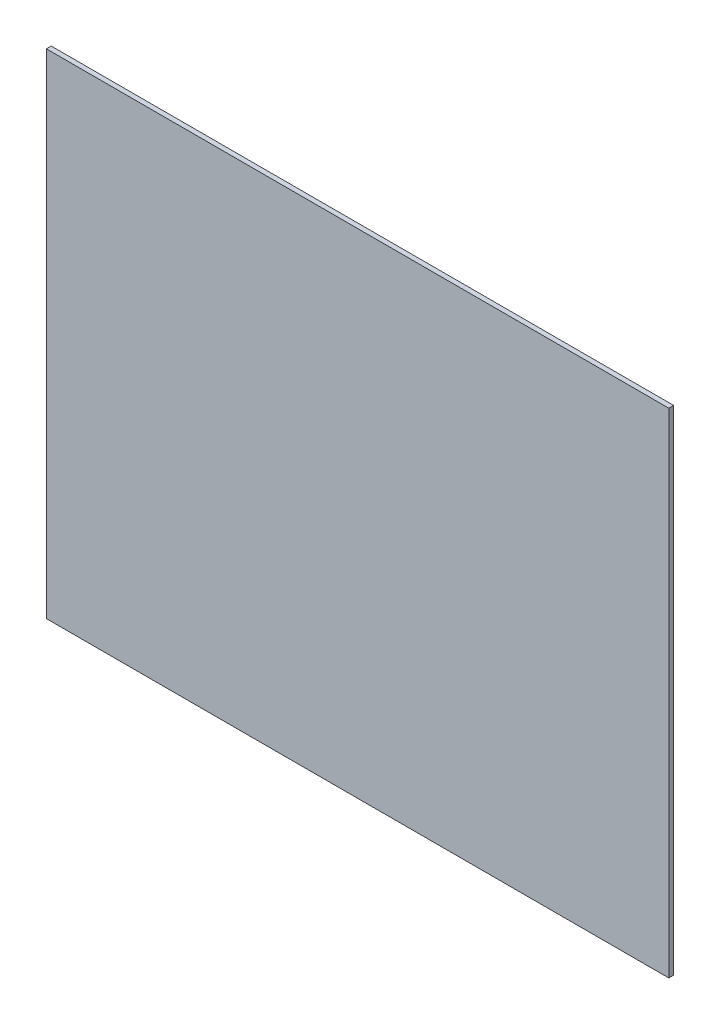
ISO-10303-21;
HEADER;
FILE_DESCRIPTION(('STEP AP214'),'2;1');
FILE_NAME('part.step','',(''),(''),'','','');
FILE_SCHEMA(('AUTOMOTIVE_DESIGN { 1 0 10303 214 1 1 1 1 }'));
ENDSEC;
DATA;
#1=APPLICATION_CONTEXT('core data for automotive mechanical design processes');
#2=APPLICATION_PROTOCOL_DEFINITION('international standard','automotive_design',2000,#1);
#3=PRODUCT_CONTEXT('',#1,'mechanical');
#4=PRODUCT('Part','Part','',(#3));
#5=PRODUCT_RELATED_PRODUCT_CATEGORY('part','',(#4));
#6=PRODUCT_DEFINITION_FORMATION('','',#4);
#7=PRODUCT_DEFINITION_CONTEXT('part definition',#1,'design');
#8=PRODUCT_DEFINITION('design','',#6,#7);
#9=PRODUCT_DEFINITION_SHAPE('','',#8);
#10=(LENGTH_UNIT() NAMED_UNIT(*) SI_UNIT(.MILLI.,.METRE.));
#11=(NAMED_UNIT(*) PLANE_ANGLE_UNIT() SI_UNIT($,.RADIAN.));
#12=(NAMED_UNIT(*) SI_UNIT($,.STERADIAN.) SOLID_ANGLE_UNIT());
#13=UNCERTAINTY_MEASURE_WITH_UNIT(LENGTH_MEASURE(1.E-05),#10,'distance_accuracy_value','');
#14=(GEOMETRIC_REPRESENTATION_CONTEXT(3) GLOBAL_UNCERTAINTY_ASSIGNED_CONTEXT((#13)) GLOBAL_UNIT_ASSIGNED_CONTEXT((#10,
#11,#12)) REPRESENTATION_CONTEXT('',''));
#15=CARTESIAN_POINT('',(0.,0.,0.));
#16=DIRECTION('',(0.,0.,1.));
#17=DIRECTION('',(1.,0.,0.));
#18=AXIS2_PLACEMENT_3D('',#15,#16,#17);
#19=CARTESIAN_POINT('',(289.5,-229.5,2.2479));
#20=DIRECTION('',(-1.,0.,0.));
#21=DIRECTION('',(0.,0.,1.));
#22=AXIS2_PLACEMENT_3D('',#19,#20,#21);
#23=PLANE('',#22);
#24=DIRECTION('',(0.,1.,0.));
#25=VECTOR('',#24,1.);
#26=CARTESIAN_POINT('',(289.5,-229.5,-2.2479));
#27=LINE('',#26,#25);
#28=CARTESIAN_POINT('',(289.5,-229.5,-2.2479));
#29=VERTEX_POINT('',#28);
#30=CARTESIAN_POINT('',(289.5,229.5,-2.2479));
#31=VERTEX_POINT('',#30);
#32=EDGE_CURVE('E96',#29,#31,#27,.T.);
#33=ORIENTED_EDGE('',*,*,#32,.T.);
#34=DIRECTION('',(0.,0.,-1.));
#35=VECTOR('',#34,1.);
#36=CARTESIAN_POINT('',(289.5,229.5,2.2479));
#37=LINE('',#36,#35);
#38=CARTESIAN_POINT('',(289.5,229.5,2.2479));
#39=VERTEX_POINT('',#38);
#40=EDGE_CURVE('E11',#39,#31,#37,.T.);
#41=ORIENTED_EDGE('',*,*,#40,.F.);
#42=DIRECTION('',(0.,1.,0.));
#43=VECTOR('',#42,1.);
#44=CARTESIAN_POINT('',(289.5,-229.5,2.2479));
#45=LINE('',#44,#43);
#46=CARTESIAN_POINT('',(289.5,-229.5,2.2479));
#47=VERTEX_POINT('',#46);
#48=EDGE_CURVE('E84',#47,#39,#45,.T.);
#49=ORIENTED_EDGE('',*,*,#48,.F.);
#50=DIRECTION('',(0.,0.,-1.));
#51=VECTOR('',#50,1.);
#52=CARTESIAN_POINT('',(289.5,-229.5,2.2479));
#53=LINE('',#52,#51);
#54=EDGE_CURVE('E92',#47,#29,#53,.T.);
#55=ORIENTED_EDGE('',*,*,#54,.T.);
#56=EDGE_LOOP('',(#33,#41,#49,#55));
#57=FACE_BOUND('',#56,.T.);
#58=ADVANCED_FACE('F33',(#57),#23,.F.);
#59=CARTESIAN_POINT('',(-289.5,229.5,2.2479));
#60=DIRECTION('',(0.,-1.,0.));
#61=DIRECTION('',(0.,0.,-1.));
#62=AXIS2_PLACEMENT_3D('',#59,#60,#61);
#63=PLANE('',#62);
#64=DIRECTION('',(-1.,0.,0.));
#65=VECTOR('',#64,1.);
#66=CARTESIAN_POINT('',(-289.5,229.5,-2.2479));
#67=LINE('',#66,#65);
#68=CARTESIAN_POINT('',(-289.5,229.5,-2.2479));
#69=VERTEX_POINT('',#68);
#70=EDGE_CURVE('E88',#31,#69,#67,.T.);
#71=ORIENTED_EDGE('',*,*,#70,.T.);
#72=DIRECTION('',(0.,0.,-1.));
#73=VECTOR('',#72,1.);
#74=CARTESIAN_POINT('',(-289.5,229.5,2.2479));
#75=LINE('',#74,#73);
#76=CARTESIAN_POINT('',(-289.5,229.5,2.2479));
#77=VERTEX_POINT('',#76);
#78=EDGE_CURVE('E41',#77,#69,#75,.T.);
#79=ORIENTED_EDGE('',*,*,#78,.F.);
#80=DIRECTION('',(-1.,0.,0.));
#81=VECTOR('',#80,1.);
#82=CARTESIAN_POINT('',(-289.5,229.5,2.2479));
#83=LINE('',#82,#81);
#84=EDGE_CURVE('E79',#39,#77,#83,.T.);
#85=ORIENTED_EDGE('',*,*,#84,.F.);
#86=ORIENTED_EDGE('',*,*,#40,.T.);
#87=EDGE_LOOP('',(#71,#79,#85,#86));
#88=FACE_BOUND('',#87,.T.);
#89=ADVANCED_FACE('F87',(#88),#63,.F.);
#90=CARTESIAN_POINT('',(-289.5,-229.5,2.2479));
#91=DIRECTION('',(1.,0.,0.));
#92=DIRECTION('',(0.,0.,-1.));
#93=AXIS2_PLACEMENT_3D('',#90,#91,#92);
#94=PLANE('',#93);
#95=DIRECTION('',(0.,-1.,0.));
#96=VECTOR('',#95,1.);
#97=CARTESIAN_POINT('',(-289.5,-229.5,-2.2479));
#98=LINE('',#97,#96);
#99=CARTESIAN_POINT('',(-289.5,-229.5,-2.2479));
#100=VERTEX_POINT('',#99);
#101=EDGE_CURVE('E66',#69,#100,#98,.T.);
#102=ORIENTED_EDGE('',*,*,#101,.T.);
#103=DIRECTION('',(0.,0.,-1.));
#104=VECTOR('',#103,1.);
#105=CARTESIAN_POINT('',(-289.5,-229.5,2.2479));
#106=LINE('',#105,#104);
#107=CARTESIAN_POINT('',(-289.5,-229.5,2.2479));
#108=VERTEX_POINT('',#107);
#109=EDGE_CURVE('E89',#108,#100,#106,.T.);
#110=ORIENTED_EDGE('',*,*,#109,.F.);
#111=DIRECTION('',(0.,-1.,0.));
#112=VECTOR('',#111,1.);
#113=CARTESIAN_POINT('',(-289.5,-229.5,2.2479));
#114=LINE('',#113,#112);
#115=EDGE_CURVE('E82',#77,#108,#114,.T.);
#116=ORIENTED_EDGE('',*,*,#115,.F.);
#117=ORIENTED_EDGE('',*,*,#78,.T.);
#118=EDGE_LOOP('',(#102,#110,#116,#117));
#119=FACE_BOUND('',#118,.T.);
#120=ADVANCED_FACE('F90',(#119),#94,.F.);
#121=CARTESIAN_POINT('',(-289.5,-229.5,2.2479));
#122=DIRECTION('',(0.,1.,0.));
#123=DIRECTION('',(0.,0.,1.));
#124=AXIS2_PLACEMENT_3D('',#121,#122,#123);
#125=PLANE('',#124);
#126=DIRECTION('',(1.,0.,0.));
#127=VECTOR('',#126,1.);
#128=CARTESIAN_POINT('',(-289.5,-229.5,-2.2479));
#129=LINE('',#128,#127);
#130=EDGE_CURVE('E72',#100,#29,#129,.T.);
#131=ORIENTED_EDGE('',*,*,#130,.T.);
#132=ORIENTED_EDGE('',*,*,#54,.F.);
#133=DIRECTION('',(1.,0.,0.));
#134=VECTOR('',#133,1.);
#135=CARTESIAN_POINT('',(-289.5,-229.5,2.2479));
#136=LINE('',#135,#134);
#137=EDGE_CURVE('E49',#108,#47,#136,.T.);
#138=ORIENTED_EDGE('',*,*,#137,.F.);
#139=ORIENTED_EDGE('',*,*,#109,.T.);
#140=EDGE_LOOP('',(#131,#132,#138,#139));
#141=FACE_BOUND('',#140,.T.);
#142=ADVANCED_FACE('F103',(#141),#125,.F.);
#143=CARTESIAN_POINT('',(0.,0.,2.2479));
#144=DIRECTION('',(0.,0.,-1.));
#145=DIRECTION('',(-1.,0.,0.));
#146=AXIS2_PLACEMENT_3D('',#143,#144,#145);
#147=PLANE('',#146);
#148=ORIENTED_EDGE('',*,*,#48,.T.);
#149=ORIENTED_EDGE('',*,*,#84,.T.);
#150=ORIENTED_EDGE('',*,*,#115,.T.);
#151=ORIENTED_EDGE('',*,*,#137,.T.);
#152=EDGE_LOOP('',(#148,#149,#150,#151));
#153=FACE_BOUND('',#152,.T.);
#154=ADVANCED_FACE('F80',(#153),#147,.F.);
#155=CARTESIAN_POINT('',(0.,0.,-2.2479));
#156=DIRECTION('',(0.,0.,-1.));
#157=DIRECTION('',(-1.,0.,0.));
#158=AXIS2_PLACEMENT_3D('',#155,#156,#157);
#159=PLANE('',#158);
#160=ORIENTED_EDGE('',*,*,#32,.F.);
#161=ORIENTED_EDGE('',*,*,#130,.F.);
#162=ORIENTED_EDGE('',*,*,#101,.F.);
#163=ORIENTED_EDGE('',*,*,#70,.F.);
#164=EDGE_LOOP('',(#160,#161,#162,#163));
#165=FACE_BOUND('',#164,.T.);
#166=ADVANCED_FACE('F106',(#165),#159,.T.);
#167=CLOSED_SHELL('',(#58,#89,#120,#142,#154,#166));
#168=MANIFOLD_SOLID_BREP('B2',#167);
#169=ADVANCED_BREP_SHAPE_REPRESENTATION('',(#18,#168),#14);
#170=SHAPE_DEFINITION_REPRESENTATION(#9,#169);
ENDSEC;
END-ISO-10303-21;
